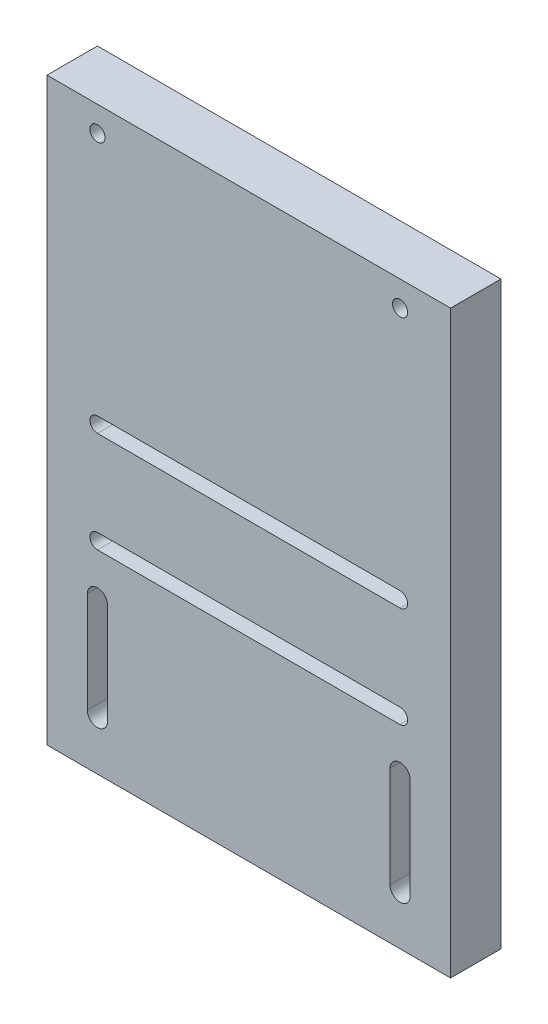
ISO-10303-21;
HEADER;
FILE_DESCRIPTION(('STEP AP214'),'2;1');
FILE_NAME('part.step','',(''),(''),'','','');
FILE_SCHEMA(('AUTOMOTIVE_DESIGN { 1 0 10303 214 1 1 1 1 }'));
ENDSEC;
DATA;
#1=APPLICATION_CONTEXT('core data for automotive mechanical design processes');
#2=APPLICATION_PROTOCOL_DEFINITION('international standard','automotive_design',2000,#1);
#3=PRODUCT_CONTEXT('',#1,'mechanical');
#4=PRODUCT('Part','Part','',(#3));
#5=PRODUCT_RELATED_PRODUCT_CATEGORY('part','',(#4));
#6=PRODUCT_DEFINITION_FORMATION('','',#4);
#7=PRODUCT_DEFINITION_CONTEXT('part definition',#1,'design');
#8=PRODUCT_DEFINITION('design','',#6,#7);
#9=PRODUCT_DEFINITION_SHAPE('','',#8);
#10=(LENGTH_UNIT() NAMED_UNIT(*) SI_UNIT(.MILLI.,.METRE.));
#11=(NAMED_UNIT(*) PLANE_ANGLE_UNIT() SI_UNIT($,.RADIAN.));
#12=(NAMED_UNIT(*) SI_UNIT($,.STERADIAN.) SOLID_ANGLE_UNIT());
#13=UNCERTAINTY_MEASURE_WITH_UNIT(LENGTH_MEASURE(1.E-05),#10,'distance_accuracy_value','');
#14=(GEOMETRIC_REPRESENTATION_CONTEXT(3) GLOBAL_UNCERTAINTY_ASSIGNED_CONTEXT((#13)) GLOBAL_UNIT_ASSIGNED_CONTEXT((#10,
#11,#12)) REPRESENTATION_CONTEXT('',''));
#15=CARTESIAN_POINT('',(0.,0.,0.));
#16=DIRECTION('',(0.,0.,1.));
#17=DIRECTION('',(1.,0.,0.));
#18=AXIS2_PLACEMENT_3D('',#15,#16,#17);
#19=CARTESIAN_POINT('',(0.,0.,10.));
#20=DIRECTION('',(0.,0.,1.));
#21=DIRECTION('',(1.,0.,0.));
#22=AXIS2_PLACEMENT_3D('',#19,#20,#21);
#23=PLANE('',#22);
#24=DIRECTION('',(0.,-1.,0.));
#25=VECTOR('',#24,1.);
#26=CARTESIAN_POINT('',(-49.7279540421685,-22.7983509814362,10.));
#27=LINE('',#26,#25);
#28=CARTESIAN_POINT('',(-49.7279540421685,-2.79835098143621,10.));
#29=VERTEX_POINT('',#28);
#30=CARTESIAN_POINT('',(-49.7279540421685,-22.7983509814362,10.));
#31=VERTEX_POINT('',#30);
#32=EDGE_CURVE('E209',#29,#31,#27,.T.);
#33=ORIENTED_EDGE('',*,*,#32,.F.);
#34=CARTESIAN_POINT('',(-47.7279540421685,-2.79835098143621,10.));
#35=DIRECTION('',(0.,0.,1.));
#36=DIRECTION('',(-1.,0.,0.));
#37=AXIS2_PLACEMENT_3D('',#34,#35,#36);
#38=CIRCLE('',#37,2.00000000000001);
#39=CARTESIAN_POINT('',(-45.7279540421685,-2.79835098143621,10.));
#40=VERTEX_POINT('',#39);
#41=EDGE_CURVE('E207',#40,#29,#38,.T.);
#42=ORIENTED_EDGE('',*,*,#41,.F.);
#43=DIRECTION('',(0.,1.,0.));
#44=VECTOR('',#43,1.);
#45=CARTESIAN_POINT('',(-45.7279540421685,-2.79835098143621,10.));
#46=LINE('',#45,#44);
#47=CARTESIAN_POINT('',(-45.7279540421685,-22.7983509814362,10.));
#48=VERTEX_POINT('',#47);
#49=EDGE_CURVE('E215',#48,#40,#46,.T.);
#50=ORIENTED_EDGE('',*,*,#49,.F.);
#51=CARTESIAN_POINT('',(-47.7279540421685,-22.7983509814362,10.));
#52=DIRECTION('',(0.,0.,1.));
#53=DIRECTION('',(1.,0.,0.));
#54=AXIS2_PLACEMENT_3D('',#51,#52,#53);
#55=CIRCLE('',#54,2.00000000000001);
#56=EDGE_CURVE('E212',#31,#48,#55,.T.);
#57=ORIENTED_EDGE('',*,*,#56,.F.);
#58=EDGE_LOOP('',(#33,#42,#50,#57));
#59=FACE_BOUND('',#58,.T.);
#60=CARTESIAN_POINT('',(-47.7279540421685,77.2016490185638,10.));
#61=DIRECTION('',(0.,0.,1.));
#62=DIRECTION('',(1.,0.,0.));
#63=AXIS2_PLACEMENT_3D('',#60,#61,#62);
#64=CIRCLE('',#63,1.5);
#65=CARTESIAN_POINT('',(-46.2279540421685,77.2016490185638,10.));
#66=VERTEX_POINT('',#65);
#67=EDGE_CURVE('E244',#66,#66,#64,.T.);
#68=ORIENTED_EDGE('',*,*,#67,.F.);
#69=EDGE_LOOP('',(#68));
#70=FACE_BOUND('',#69,.T.);
#71=DIRECTION('',(1.,0.,0.));
#72=VECTOR('',#71,1.);
#73=CARTESIAN_POINT('',(-47.7279540421685,25.7016490185638,10.));
#74=LINE('',#73,#72);
#75=CARTESIAN_POINT('',(-47.7279540421685,25.7016490185638,10.));
#76=VERTEX_POINT('',#75);
#77=CARTESIAN_POINT('',(12.2720459578315,25.7016490185638,10.));
#78=VERTEX_POINT('',#77);
#79=EDGE_CURVE('E283',#76,#78,#74,.T.);
#80=ORIENTED_EDGE('',*,*,#79,.F.);
#81=CARTESIAN_POINT('',(-47.7279540421685,27.2016490185638,10.));
#82=DIRECTION('',(0.,0.,1.));
#83=DIRECTION('',(1.,0.,0.));
#84=AXIS2_PLACEMENT_3D('',#81,#82,#83);
#85=CIRCLE('',#84,1.5);
#86=CARTESIAN_POINT('',(-47.7279540421685,28.7016490185638,10.));
#87=VERTEX_POINT('',#86);
#88=EDGE_CURVE('E281',#87,#76,#85,.T.);
#89=ORIENTED_EDGE('',*,*,#88,.F.);
#90=DIRECTION('',(-1.,0.,0.));
#91=VECTOR('',#90,1.);
#92=CARTESIAN_POINT('',(-47.7279540421685,28.7016490185638,10.));
#93=LINE('',#92,#91);
#94=CARTESIAN_POINT('',(12.2720459578315,28.7016490185638,10.));
#95=VERTEX_POINT('',#94);
#96=EDGE_CURVE('E289',#95,#87,#93,.T.);
#97=ORIENTED_EDGE('',*,*,#96,.F.);
#98=CARTESIAN_POINT('',(12.2720459578315,27.2016490185638,10.));
#99=DIRECTION('',(0.,0.,1.));
#100=DIRECTION('',(-1.,0.,0.));
#101=AXIS2_PLACEMENT_3D('',#98,#99,#100);
#102=CIRCLE('',#101,1.5);
#103=EDGE_CURVE('E286',#78,#95,#102,.T.);
#104=ORIENTED_EDGE('',*,*,#103,.F.);
#105=EDGE_LOOP('',(#80,#89,#97,#104));
#106=FACE_BOUND('',#105,.T.);
#107=DIRECTION('',(0.,-1.,0.));
#108=VECTOR('',#107,1.);
#109=CARTESIAN_POINT('',(-57.7279540421685,82.2016490185638,10.));
#110=LINE('',#109,#108);
#111=CARTESIAN_POINT('',(-57.7279540421685,82.2016490185638,10.));
#112=VERTEX_POINT('',#111);
#113=CARTESIAN_POINT('',(-57.7279540421685,-32.7983509814362,10.));
#114=VERTEX_POINT('',#113);
#115=EDGE_CURVE('E312',#112,#114,#110,.T.);
#116=ORIENTED_EDGE('',*,*,#115,.T.);
#117=DIRECTION('',(1.,0.,0.));
#118=VECTOR('',#117,1.);
#119=CARTESIAN_POINT('',(-57.7279540421685,-32.7983509814362,10.));
#120=LINE('',#119,#118);
#121=CARTESIAN_POINT('',(22.2720459578315,-32.7983509814362,10.));
#122=VERTEX_POINT('',#121);
#123=EDGE_CURVE('E315',#114,#122,#120,.T.);
#124=ORIENTED_EDGE('',*,*,#123,.T.);
#125=DIRECTION('',(0.,1.,0.));
#126=VECTOR('',#125,1.);
#127=CARTESIAN_POINT('',(22.2720459578315,82.2016490185638,10.));
#128=LINE('',#127,#126);
#129=CARTESIAN_POINT('',(22.2720459578315,82.2016490185638,10.));
#130=VERTEX_POINT('',#129);
#131=EDGE_CURVE('E318',#122,#130,#128,.T.);
#132=ORIENTED_EDGE('',*,*,#131,.T.);
#133=DIRECTION('',(-1.,0.,0.));
#134=VECTOR('',#133,1.);
#135=CARTESIAN_POINT('',(-57.7279540421685,82.2016490185638,10.));
#136=LINE('',#135,#134);
#137=EDGE_CURVE('E320',#130,#112,#136,.T.);
#138=ORIENTED_EDGE('',*,*,#137,.T.);
#139=EDGE_LOOP('',(#116,#124,#132,#138));
#140=FACE_BOUND('',#139,.T.);
#141=DIRECTION('',(1.,0.,0.));
#142=VECTOR('',#141,1.);
#143=CARTESIAN_POINT('',(12.2720459578315,5.70164901856379,10.));
#144=LINE('',#143,#142);
#145=CARTESIAN_POINT('',(-47.7279540421685,5.70164901856378,10.));
#146=VERTEX_POINT('',#145);
#147=CARTESIAN_POINT('',(12.2720459578315,5.70164901856379,10.));
#148=VERTEX_POINT('',#147);
#149=EDGE_CURVE('E252',#146,#148,#144,.T.);
#150=ORIENTED_EDGE('',*,*,#149,.F.);
#151=CARTESIAN_POINT('',(-47.7279540421685,7.20164901856379,10.));
#152=DIRECTION('',(0.,0.,1.));
#153=DIRECTION('',(1.,0.,0.));
#154=AXIS2_PLACEMENT_3D('',#151,#152,#153);
#155=CIRCLE('',#154,1.5);
#156=CARTESIAN_POINT('',(-47.7279540421685,8.70164901856379,10.));
#157=VERTEX_POINT('',#156);
#158=EDGE_CURVE('E250',#157,#146,#155,.T.);
#159=ORIENTED_EDGE('',*,*,#158,.F.);
#160=DIRECTION('',(-1.,0.,0.));
#161=VECTOR('',#160,1.);
#162=CARTESIAN_POINT('',(-47.7279540421685,8.70164901856379,10.));
#163=LINE('',#162,#161);
#164=CARTESIAN_POINT('',(12.2720459578315,8.70164901856379,10.));
#165=VERTEX_POINT('',#164);
#166=EDGE_CURVE('E258',#165,#157,#163,.T.);
#167=ORIENTED_EDGE('',*,*,#166,.F.);
#168=CARTESIAN_POINT('',(12.2720459578315,7.20164901856379,10.));
#169=DIRECTION('',(0.,0.,1.));
#170=DIRECTION('',(-1.,0.,0.));
#171=AXIS2_PLACEMENT_3D('',#168,#169,#170);
#172=CIRCLE('',#171,1.5);
#173=EDGE_CURVE('E255',#148,#165,#172,.T.);
#174=ORIENTED_EDGE('',*,*,#173,.F.);
#175=EDGE_LOOP('',(#150,#159,#167,#174));
#176=FACE_BOUND('',#175,.T.);
#177=CARTESIAN_POINT('',(12.2720459578315,77.2016490185638,10.));
#178=DIRECTION('',(0.,0.,1.));
#179=DIRECTION('',(1.,0.,0.));
#180=AXIS2_PLACEMENT_3D('',#177,#178,#179);
#181=CIRCLE('',#180,1.5);
#182=CARTESIAN_POINT('',(13.7720459578315,77.2016490185638,10.));
#183=VERTEX_POINT('',#182);
#184=EDGE_CURVE('E238',#183,#183,#181,.T.);
#185=ORIENTED_EDGE('',*,*,#184,.F.);
#186=EDGE_LOOP('',(#185));
#187=FACE_BOUND('',#186,.T.);
#188=DIRECTION('',(0.,-1.,0.));
#189=VECTOR('',#188,1.);
#190=CARTESIAN_POINT('',(10.2720459578315,-2.79835098143621,10.));
#191=LINE('',#190,#189);
#192=CARTESIAN_POINT('',(10.2720459578315,-2.79835098143621,10.));
#193=VERTEX_POINT('',#192);
#194=CARTESIAN_POINT('',(10.2720459578315,-22.7983509814362,10.));
#195=VERTEX_POINT('',#194);
#196=EDGE_CURVE('E179',#193,#195,#191,.T.);
#197=ORIENTED_EDGE('',*,*,#196,.F.);
#198=CARTESIAN_POINT('',(12.2720459578315,-2.79835098143621,10.));
#199=DIRECTION('',(0.,0.,1.));
#200=DIRECTION('',(-1.,0.,0.));
#201=AXIS2_PLACEMENT_3D('',#198,#199,#200);
#202=CIRCLE('',#201,2.);
#203=CARTESIAN_POINT('',(14.2720459578315,-2.79835098143621,10.));
#204=VERTEX_POINT('',#203);
#205=EDGE_CURVE('E171',#204,#193,#202,.T.);
#206=ORIENTED_EDGE('',*,*,#205,.F.);
#207=DIRECTION('',(0.,1.,0.));
#208=VECTOR('',#207,1.);
#209=CARTESIAN_POINT('',(14.2720459578315,-22.7983509814362,10.));
#210=LINE('',#209,#208);
#211=CARTESIAN_POINT('',(14.2720459578315,-22.7983509814362,10.));
#212=VERTEX_POINT('',#211);
#213=EDGE_CURVE('E193',#212,#204,#210,.T.);
#214=ORIENTED_EDGE('',*,*,#213,.F.);
#215=CARTESIAN_POINT('',(12.2720459578315,-22.7983509814362,10.));
#216=DIRECTION('',(0.,0.,1.));
#217=DIRECTION('',(1.,0.,0.));
#218=AXIS2_PLACEMENT_3D('',#215,#216,#217);
#219=CIRCLE('',#218,2.00000000000001);
#220=EDGE_CURVE('E191',#195,#212,#219,.T.);
#221=ORIENTED_EDGE('',*,*,#220,.F.);
#222=EDGE_LOOP('',(#197,#206,#214,#221));
#223=FACE_BOUND('',#222,.T.);
#224=ADVANCED_FACE('F34',(#59,#70,#106,#140,#176,#187,#223),#23,.T.);
#225=CARTESIAN_POINT('',(0.,0.,0.));
#226=DIRECTION('',(0.,0.,1.));
#227=DIRECTION('',(1.,0.,0.));
#228=AXIS2_PLACEMENT_3D('',#225,#226,#227);
#229=PLANE('',#228);
#230=CARTESIAN_POINT('',(-47.7279540421685,-2.79835098143621,0.));
#231=DIRECTION('',(0.,0.,1.));
#232=DIRECTION('',(-1.,0.,0.));
#233=AXIS2_PLACEMENT_3D('',#230,#231,#232);
#234=CIRCLE('',#233,2.00000000000001);
#235=CARTESIAN_POINT('',(-45.7279540421685,-2.79835098143621,0.));
#236=VERTEX_POINT('',#235);
#237=CARTESIAN_POINT('',(-49.7279540421685,-2.79835098143621,0.));
#238=VERTEX_POINT('',#237);
#239=EDGE_CURVE('E187',#236,#238,#234,.T.);
#240=ORIENTED_EDGE('',*,*,#239,.T.);
#241=DIRECTION('',(0.,-1.,0.));
#242=VECTOR('',#241,1.);
#243=CARTESIAN_POINT('',(-49.7279540421685,-22.7983509814362,0.));
#244=LINE('',#243,#242);
#245=CARTESIAN_POINT('',(-49.7279540421685,-22.7983509814362,0.));
#246=VERTEX_POINT('',#245);
#247=EDGE_CURVE('E220',#238,#246,#244,.T.);
#248=ORIENTED_EDGE('',*,*,#247,.T.);
#249=CARTESIAN_POINT('',(-47.7279540421685,-22.7983509814362,0.));
#250=DIRECTION('',(0.,0.,1.));
#251=DIRECTION('',(1.,0.,0.));
#252=AXIS2_PLACEMENT_3D('',#249,#250,#251);
#253=CIRCLE('',#252,2.00000000000001);
#254=CARTESIAN_POINT('',(-45.7279540421685,-22.7983509814362,0.));
#255=VERTEX_POINT('',#254);
#256=EDGE_CURVE('E223',#246,#255,#253,.T.);
#257=ORIENTED_EDGE('',*,*,#256,.T.);
#258=DIRECTION('',(0.,1.,0.));
#259=VECTOR('',#258,1.);
#260=CARTESIAN_POINT('',(-45.7279540421685,-2.79835098143621,0.));
#261=LINE('',#260,#259);
#262=EDGE_CURVE('E210',#255,#236,#261,.T.);
#263=ORIENTED_EDGE('',*,*,#262,.T.);
#264=EDGE_LOOP('',(#240,#248,#257,#263));
#265=FACE_BOUND('',#264,.T.);
#266=CARTESIAN_POINT('',(-47.7279540421685,77.2016490185638,0.));
#267=DIRECTION('',(0.,0.,1.));
#268=DIRECTION('',(1.,0.,0.));
#269=AXIS2_PLACEMENT_3D('',#266,#267,#268);
#270=CIRCLE('',#269,1.5);
#271=CARTESIAN_POINT('',(-46.2279540421685,77.2016490185638,0.));
#272=VERTEX_POINT('',#271);
#273=EDGE_CURVE('E241',#272,#272,#270,.T.);
#274=ORIENTED_EDGE('',*,*,#273,.T.);
#275=EDGE_LOOP('',(#274));
#276=FACE_BOUND('',#275,.T.);
#277=CARTESIAN_POINT('',(-47.7279540421685,27.2016490185638,0.));
#278=DIRECTION('',(0.,0.,1.));
#279=DIRECTION('',(1.,0.,0.));
#280=AXIS2_PLACEMENT_3D('',#277,#278,#279);
#281=CIRCLE('',#280,1.5);
#282=CARTESIAN_POINT('',(-47.7279540421685,28.7016490185638,0.));
#283=VERTEX_POINT('',#282);
#284=CARTESIAN_POINT('',(-47.7279540421685,25.7016490185638,0.));
#285=VERTEX_POINT('',#284);
#286=EDGE_CURVE('E280',#283,#285,#281,.T.);
#287=ORIENTED_EDGE('',*,*,#286,.T.);
#288=DIRECTION('',(1.,0.,0.));
#289=VECTOR('',#288,1.);
#290=CARTESIAN_POINT('',(-47.7279540421685,25.7016490185638,0.));
#291=LINE('',#290,#289);
#292=CARTESIAN_POINT('',(12.2720459578315,25.7016490185638,0.));
#293=VERTEX_POINT('',#292);
#294=EDGE_CURVE('E294',#285,#293,#291,.T.);
#295=ORIENTED_EDGE('',*,*,#294,.T.);
#296=CARTESIAN_POINT('',(12.2720459578315,27.2016490185638,0.));
#297=DIRECTION('',(0.,0.,1.));
#298=DIRECTION('',(-1.,0.,0.));
#299=AXIS2_PLACEMENT_3D('',#296,#297,#298);
#300=CIRCLE('',#299,1.5);
#301=CARTESIAN_POINT('',(12.2720459578315,28.7016490185638,0.));
#302=VERTEX_POINT('',#301);
#303=EDGE_CURVE('E297',#293,#302,#300,.T.);
#304=ORIENTED_EDGE('',*,*,#303,.T.);
#305=DIRECTION('',(-1.,0.,0.));
#306=VECTOR('',#305,1.);
#307=CARTESIAN_POINT('',(-47.7279540421685,28.7016490185638,0.));
#308=LINE('',#307,#306);
#309=EDGE_CURVE('E284',#302,#283,#308,.T.);
#310=ORIENTED_EDGE('',*,*,#309,.T.);
#311=EDGE_LOOP('',(#287,#295,#304,#310));
#312=FACE_BOUND('',#311,.T.);
#313=DIRECTION('',(0.,-1.,0.));
#314=VECTOR('',#313,1.);
#315=CARTESIAN_POINT('',(-57.7279540421685,82.2016490185638,0.));
#316=LINE('',#315,#314);
#317=CARTESIAN_POINT('',(-57.7279540421685,82.2016490185638,0.));
#318=VERTEX_POINT('',#317);
#319=CARTESIAN_POINT('',(-57.7279540421685,-32.7983509814362,0.));
#320=VERTEX_POINT('',#319);
#321=EDGE_CURVE('E311',#318,#320,#316,.T.);
#322=ORIENTED_EDGE('',*,*,#321,.F.);
#323=DIRECTION('',(-1.,0.,0.));
#324=VECTOR('',#323,1.);
#325=CARTESIAN_POINT('',(-57.7279540421685,82.2016490185638,0.));
#326=LINE('',#325,#324);
#327=CARTESIAN_POINT('',(22.2720459578315,82.2016490185638,0.));
#328=VERTEX_POINT('',#327);
#329=EDGE_CURVE('E316',#328,#318,#326,.T.);
#330=ORIENTED_EDGE('',*,*,#329,.F.);
#331=DIRECTION('',(0.,1.,0.));
#332=VECTOR('',#331,1.);
#333=CARTESIAN_POINT('',(22.2720459578315,82.2016490185638,0.));
#334=LINE('',#333,#332);
#335=CARTESIAN_POINT('',(22.2720459578315,-32.7983509814362,0.));
#336=VERTEX_POINT('',#335);
#337=EDGE_CURVE('E327',#336,#328,#334,.T.);
#338=ORIENTED_EDGE('',*,*,#337,.F.);
#339=DIRECTION('',(1.,0.,0.));
#340=VECTOR('',#339,1.);
#341=CARTESIAN_POINT('',(-57.7279540421685,-32.7983509814362,0.));
#342=LINE('',#341,#340);
#343=EDGE_CURVE('E325',#320,#336,#342,.T.);
#344=ORIENTED_EDGE('',*,*,#343,.F.);
#345=EDGE_LOOP('',(#322,#330,#338,#344));
#346=FACE_BOUND('',#345,.T.);
#347=CARTESIAN_POINT('',(-47.7279540421685,7.20164901856379,0.));
#348=DIRECTION('',(0.,0.,1.));
#349=DIRECTION('',(1.,0.,0.));
#350=AXIS2_PLACEMENT_3D('',#347,#348,#349);
#351=CIRCLE('',#350,1.5);
#352=CARTESIAN_POINT('',(-47.7279540421685,8.70164901856379,0.));
#353=VERTEX_POINT('',#352);
#354=CARTESIAN_POINT('',(-47.7279540421685,5.70164901856378,0.));
#355=VERTEX_POINT('',#354);
#356=EDGE_CURVE('E247',#353,#355,#351,.T.);
#357=ORIENTED_EDGE('',*,*,#356,.T.);
#358=DIRECTION('',(1.,0.,0.));
#359=VECTOR('',#358,1.);
#360=CARTESIAN_POINT('',(12.2720459578315,5.70164901856379,0.));
#361=LINE('',#360,#359);
#362=CARTESIAN_POINT('',(12.2720459578315,5.70164901856379,0.));
#363=VERTEX_POINT('',#362);
#364=EDGE_CURVE('E263',#355,#363,#361,.T.);
#365=ORIENTED_EDGE('',*,*,#364,.T.);
#366=CARTESIAN_POINT('',(12.2720459578315,7.20164901856379,0.));
#367=DIRECTION('',(0.,0.,1.));
#368=DIRECTION('',(-1.,0.,0.));
#369=AXIS2_PLACEMENT_3D('',#366,#367,#368);
#370=CIRCLE('',#369,1.5);
#371=CARTESIAN_POINT('',(12.2720459578315,8.70164901856379,0.));
#372=VERTEX_POINT('',#371);
#373=EDGE_CURVE('E266',#363,#372,#370,.T.);
#374=ORIENTED_EDGE('',*,*,#373,.T.);
#375=DIRECTION('',(-1.,0.,0.));
#376=VECTOR('',#375,1.);
#377=CARTESIAN_POINT('',(-47.7279540421685,8.70164901856379,0.));
#378=LINE('',#377,#376);
#379=EDGE_CURVE('E253',#372,#353,#378,.T.);
#380=ORIENTED_EDGE('',*,*,#379,.T.);
#381=EDGE_LOOP('',(#357,#365,#374,#380));
#382=FACE_BOUND('',#381,.T.);
#383=CARTESIAN_POINT('',(12.2720459578315,77.2016490185638,0.));
#384=DIRECTION('',(0.,0.,1.));
#385=DIRECTION('',(1.,0.,0.));
#386=AXIS2_PLACEMENT_3D('',#383,#384,#385);
#387=CIRCLE('',#386,1.5);
#388=CARTESIAN_POINT('',(13.7720459578315,77.2016490185638,0.));
#389=VERTEX_POINT('',#388);
#390=EDGE_CURVE('E237',#389,#389,#387,.T.);
#391=ORIENTED_EDGE('',*,*,#390,.T.);
#392=EDGE_LOOP('',(#391));
#393=FACE_BOUND('',#392,.T.);
#394=CARTESIAN_POINT('',(12.2720459578315,-2.79835098143621,0.));
#395=DIRECTION('',(0.,0.,1.));
#396=DIRECTION('',(-1.,0.,0.));
#397=AXIS2_PLACEMENT_3D('',#394,#395,#396);
#398=CIRCLE('',#397,2.);
#399=CARTESIAN_POINT('',(14.2720459578315,-2.79835098143621,0.));
#400=VERTEX_POINT('',#399);
#401=CARTESIAN_POINT('',(10.2720459578315,-2.79835098143621,0.));
#402=VERTEX_POINT('',#401);
#403=EDGE_CURVE('E57',#400,#402,#398,.T.);
#404=ORIENTED_EDGE('',*,*,#403,.T.);
#405=DIRECTION('',(0.,-1.,0.));
#406=VECTOR('',#405,1.);
#407=CARTESIAN_POINT('',(10.2720459578315,-2.79835098143621,0.));
#408=LINE('',#407,#406);
#409=CARTESIAN_POINT('',(10.2720459578315,-22.7983509814362,0.));
#410=VERTEX_POINT('',#409);
#411=EDGE_CURVE('E186',#402,#410,#408,.T.);
#412=ORIENTED_EDGE('',*,*,#411,.T.);
#413=CARTESIAN_POINT('',(12.2720459578315,-22.7983509814362,0.));
#414=DIRECTION('',(0.,0.,1.));
#415=DIRECTION('',(1.,0.,0.));
#416=AXIS2_PLACEMENT_3D('',#413,#414,#415);
#417=CIRCLE('',#416,2.00000000000001);
#418=CARTESIAN_POINT('',(14.2720459578315,-22.7983509814362,0.));
#419=VERTEX_POINT('',#418);
#420=EDGE_CURVE('E199',#410,#419,#417,.T.);
#421=ORIENTED_EDGE('',*,*,#420,.T.);
#422=DIRECTION('',(0.,1.,0.));
#423=VECTOR('',#422,1.);
#424=CARTESIAN_POINT('',(14.2720459578315,-22.7983509814362,0.));
#425=LINE('',#424,#423);
#426=EDGE_CURVE('E180',#419,#400,#425,.T.);
#427=ORIENTED_EDGE('',*,*,#426,.T.);
#428=EDGE_LOOP('',(#404,#412,#421,#427));
#429=FACE_BOUND('',#428,.T.);
#430=ADVANCED_FACE('F345',(#265,#276,#312,#346,#382,#393,#429),#229,.F.);
#431=CARTESIAN_POINT('',(-57.7279540421685,82.2016490185638,10.));
#432=DIRECTION('',(1.,0.,0.));
#433=DIRECTION('',(0.,1.,0.));
#434=AXIS2_PLACEMENT_3D('',#431,#432,#433);
#435=PLANE('',#434);
#436=ORIENTED_EDGE('',*,*,#321,.T.);
#437=DIRECTION('',(0.,0.,-1.));
#438=VECTOR('',#437,1.);
#439=CARTESIAN_POINT('',(-57.7279540421685,-32.7983509814362,10.));
#440=LINE('',#439,#438);
#441=EDGE_CURVE('E11',#114,#320,#440,.T.);
#442=ORIENTED_EDGE('',*,*,#441,.F.);
#443=ORIENTED_EDGE('',*,*,#115,.F.);
#444=DIRECTION('',(0.,0.,-1.));
#445=VECTOR('',#444,1.);
#446=CARTESIAN_POINT('',(-57.7279540421685,82.2016490185638,10.));
#447=LINE('',#446,#445);
#448=EDGE_CURVE('E322',#112,#318,#447,.T.);
#449=ORIENTED_EDGE('',*,*,#448,.T.);
#450=EDGE_LOOP('',(#436,#442,#443,#449));
#451=FACE_BOUND('',#450,.T.);
#452=ADVANCED_FACE('F36',(#451),#435,.F.);
#453=CARTESIAN_POINT('',(-57.7279540421685,-32.7983509814362,10.));
#454=DIRECTION('',(0.,1.,0.));
#455=DIRECTION('',(0.,0.,1.));
#456=AXIS2_PLACEMENT_3D('',#453,#454,#455);
#457=PLANE('',#456);
#458=ORIENTED_EDGE('',*,*,#343,.T.);
#459=DIRECTION('',(0.,0.,-1.));
#460=VECTOR('',#459,1.);
#461=CARTESIAN_POINT('',(22.2720459578315,-32.7983509814362,10.));
#462=LINE('',#461,#460);
#463=EDGE_CURVE('E42',#122,#336,#462,.T.);
#464=ORIENTED_EDGE('',*,*,#463,.F.);
#465=ORIENTED_EDGE('',*,*,#123,.F.);
#466=ORIENTED_EDGE('',*,*,#441,.T.);
#467=EDGE_LOOP('',(#458,#464,#465,#466));
#468=FACE_BOUND('',#467,.T.);
#469=ADVANCED_FACE('F356',(#468),#457,.F.);
#470=CARTESIAN_POINT('',(22.2720459578315,82.2016490185638,10.));
#471=DIRECTION('',(-1.,0.,0.));
#472=DIRECTION('',(0.,-1.,0.));
#473=AXIS2_PLACEMENT_3D('',#470,#471,#472);
#474=PLANE('',#473);
#475=ORIENTED_EDGE('',*,*,#337,.T.);
#476=DIRECTION('',(0.,0.,-1.));
#477=VECTOR('',#476,1.);
#478=CARTESIAN_POINT('',(22.2720459578315,82.2016490185638,10.));
#479=LINE('',#478,#477);
#480=EDGE_CURVE('E332',#130,#328,#479,.T.);
#481=ORIENTED_EDGE('',*,*,#480,.F.);
#482=ORIENTED_EDGE('',*,*,#131,.F.);
#483=ORIENTED_EDGE('',*,*,#463,.T.);
#484=EDGE_LOOP('',(#475,#481,#482,#483));
#485=FACE_BOUND('',#484,.T.);
#486=ADVANCED_FACE('F339',(#485),#474,.F.);
#487=CARTESIAN_POINT('',(-57.7279540421685,82.2016490185638,10.));
#488=DIRECTION('',(0.,-1.,0.));
#489=DIRECTION('',(1.,0.,0.));
#490=AXIS2_PLACEMENT_3D('',#487,#488,#489);
#491=PLANE('',#490);
#492=ORIENTED_EDGE('',*,*,#329,.T.);
#493=ORIENTED_EDGE('',*,*,#448,.F.);
#494=ORIENTED_EDGE('',*,*,#137,.F.);
#495=ORIENTED_EDGE('',*,*,#480,.T.);
#496=EDGE_LOOP('',(#492,#493,#494,#495));
#497=FACE_BOUND('',#496,.T.);
#498=ADVANCED_FACE('F349',(#497),#491,.F.);
#499=CARTESIAN_POINT('',(-47.7279540421685,27.2016490185638,10.));
#500=DIRECTION('',(0.,0.,-1.));
#501=DIRECTION('',(-1.,0.,0.));
#502=AXIS2_PLACEMENT_3D('',#499,#500,#501);
#503=CYLINDRICAL_SURFACE('',#502,1.5);
#504=ORIENTED_EDGE('',*,*,#286,.F.);
#505=DIRECTION('',(0.,0.,-1.));
#506=VECTOR('',#505,1.);
#507=CARTESIAN_POINT('',(-47.7279540421685,28.7016490185638,10.));
#508=LINE('',#507,#506);
#509=EDGE_CURVE('E291',#87,#283,#508,.T.);
#510=ORIENTED_EDGE('',*,*,#509,.F.);
#511=ORIENTED_EDGE('',*,*,#88,.T.);
#512=DIRECTION('',(0.,0.,-1.));
#513=VECTOR('',#512,1.);
#514=CARTESIAN_POINT('',(-47.7279540421685,25.7016490185638,10.));
#515=LINE('',#514,#513);
#516=EDGE_CURVE('E308',#76,#285,#515,.T.);
#517=ORIENTED_EDGE('',*,*,#516,.T.);
#518=EDGE_LOOP('',(#504,#510,#511,#517));
#519=FACE_BOUND('',#518,.T.);
#520=ADVANCED_FACE('F374',(#519),#503,.F.);
#521=CARTESIAN_POINT('',(-47.7279540421685,25.7016490185638,10.));
#522=DIRECTION('',(0.,1.,0.));
#523=DIRECTION('',(-1.,0.,0.));
#524=AXIS2_PLACEMENT_3D('',#521,#522,#523);
#525=PLANE('',#524);
#526=ORIENTED_EDGE('',*,*,#294,.F.);
#527=ORIENTED_EDGE('',*,*,#516,.F.);
#528=ORIENTED_EDGE('',*,*,#79,.T.);
#529=DIRECTION('',(0.,0.,-1.));
#530=VECTOR('',#529,1.);
#531=CARTESIAN_POINT('',(12.2720459578315,25.7016490185638,10.));
#532=LINE('',#531,#530);
#533=EDGE_CURVE('E306',#78,#293,#532,.T.);
#534=ORIENTED_EDGE('',*,*,#533,.T.);
#535=EDGE_LOOP('',(#526,#527,#528,#534));
#536=FACE_BOUND('',#535,.T.);
#537=ADVANCED_FACE('F381',(#536),#525,.T.);
#538=CARTESIAN_POINT('',(12.2720459578315,27.2016490185638,10.));
#539=DIRECTION('',(0.,0.,-1.));
#540=DIRECTION('',(-1.,0.,0.));
#541=AXIS2_PLACEMENT_3D('',#538,#539,#540);
#542=CYLINDRICAL_SURFACE('',#541,1.5);
#543=ORIENTED_EDGE('',*,*,#303,.F.);
#544=ORIENTED_EDGE('',*,*,#533,.F.);
#545=ORIENTED_EDGE('',*,*,#103,.T.);
#546=DIRECTION('',(0.,0.,-1.));
#547=VECTOR('',#546,1.);
#548=CARTESIAN_POINT('',(12.2720459578315,28.7016490185638,10.));
#549=LINE('',#548,#547);
#550=EDGE_CURVE('E304',#95,#302,#549,.T.);
#551=ORIENTED_EDGE('',*,*,#550,.T.);
#552=EDGE_LOOP('',(#543,#544,#545,#551));
#553=FACE_BOUND('',#552,.T.);
#554=ADVANCED_FACE('F386',(#553),#542,.F.);
#555=CARTESIAN_POINT('',(-47.7279540421685,28.7016490185638,10.));
#556=DIRECTION('',(0.,-1.,0.));
#557=DIRECTION('',(0.,0.,-1.));
#558=AXIS2_PLACEMENT_3D('',#555,#556,#557);
#559=PLANE('',#558);
#560=ORIENTED_EDGE('',*,*,#309,.F.);
#561=ORIENTED_EDGE('',*,*,#550,.F.);
#562=ORIENTED_EDGE('',*,*,#96,.T.);
#563=ORIENTED_EDGE('',*,*,#509,.T.);
#564=EDGE_LOOP('',(#560,#561,#562,#563));
#565=FACE_BOUND('',#564,.T.);
#566=ADVANCED_FACE('F394',(#565),#559,.T.);
#567=CARTESIAN_POINT('',(-47.7279540421685,7.20164901856379,10.));
#568=DIRECTION('',(0.,0.,-1.));
#569=DIRECTION('',(-1.,0.,0.));
#570=AXIS2_PLACEMENT_3D('',#567,#568,#569);
#571=CYLINDRICAL_SURFACE('',#570,1.5);
#572=ORIENTED_EDGE('',*,*,#356,.F.);
#573=DIRECTION('',(0.,0.,-1.));
#574=VECTOR('',#573,1.);
#575=CARTESIAN_POINT('',(-47.7279540421685,8.70164901856379,10.));
#576=LINE('',#575,#574);
#577=EDGE_CURVE('E260',#157,#353,#576,.T.);
#578=ORIENTED_EDGE('',*,*,#577,.F.);
#579=ORIENTED_EDGE('',*,*,#158,.T.);
#580=DIRECTION('',(0.,0.,-1.));
#581=VECTOR('',#580,1.);
#582=CARTESIAN_POINT('',(-47.7279540421685,5.70164901856378,10.));
#583=LINE('',#582,#581);
#584=EDGE_CURVE('E277',#146,#355,#583,.T.);
#585=ORIENTED_EDGE('',*,*,#584,.T.);
#586=EDGE_LOOP('',(#572,#578,#579,#585));
#587=FACE_BOUND('',#586,.T.);
#588=ADVANCED_FACE('F407',(#587),#571,.F.);
#589=CARTESIAN_POINT('',(12.2720459578315,5.70164901856379,10.));
#590=DIRECTION('',(0.,1.,0.));
#591=DIRECTION('',(-1.,0.,0.));
#592=AXIS2_PLACEMENT_3D('',#589,#590,#591);
#593=PLANE('',#592);
#594=ORIENTED_EDGE('',*,*,#364,.F.);
#595=ORIENTED_EDGE('',*,*,#584,.F.);
#596=ORIENTED_EDGE('',*,*,#149,.T.);
#597=DIRECTION('',(0.,0.,-1.));
#598=VECTOR('',#597,1.);
#599=CARTESIAN_POINT('',(12.2720459578315,5.70164901856379,10.));
#600=LINE('',#599,#598);
#601=EDGE_CURVE('E275',#148,#363,#600,.T.);
#602=ORIENTED_EDGE('',*,*,#601,.T.);
#603=EDGE_LOOP('',(#594,#595,#596,#602));
#604=FACE_BOUND('',#603,.T.);
#605=ADVANCED_FACE('F412',(#604),#593,.T.);
#606=CARTESIAN_POINT('',(12.2720459578315,7.20164901856379,10.));
#607=DIRECTION('',(0.,0.,-1.));
#608=DIRECTION('',(-1.,0.,0.));
#609=AXIS2_PLACEMENT_3D('',#606,#607,#608);
#610=CYLINDRICAL_SURFACE('',#609,1.5);
#611=ORIENTED_EDGE('',*,*,#373,.F.);
#612=ORIENTED_EDGE('',*,*,#601,.F.);
#613=ORIENTED_EDGE('',*,*,#173,.T.);
#614=DIRECTION('',(0.,0.,-1.));
#615=VECTOR('',#614,1.);
#616=CARTESIAN_POINT('',(12.2720459578315,8.70164901856379,10.));
#617=LINE('',#616,#615);
#618=EDGE_CURVE('E273',#165,#372,#617,.T.);
#619=ORIENTED_EDGE('',*,*,#618,.T.);
#620=EDGE_LOOP('',(#611,#612,#613,#619));
#621=FACE_BOUND('',#620,.T.);
#622=ADVANCED_FACE('F416',(#621),#610,.F.);
#623=CARTESIAN_POINT('',(-47.7279540421685,8.70164901856379,10.));
#624=DIRECTION('',(0.,-1.,0.));
#625=DIRECTION('',(0.,0.,-1.));
#626=AXIS2_PLACEMENT_3D('',#623,#624,#625);
#627=PLANE('',#626);
#628=ORIENTED_EDGE('',*,*,#379,.F.);
#629=ORIENTED_EDGE('',*,*,#618,.F.);
#630=ORIENTED_EDGE('',*,*,#166,.T.);
#631=ORIENTED_EDGE('',*,*,#577,.T.);
#632=EDGE_LOOP('',(#628,#629,#630,#631));
#633=FACE_BOUND('',#632,.T.);
#634=ADVANCED_FACE('F420',(#633),#627,.T.);
#635=CARTESIAN_POINT('',(-47.7279540421685,77.2016490185638,10.));
#636=DIRECTION('',(0.,0.,-1.));
#637=DIRECTION('',(-1.,0.,0.));
#638=AXIS2_PLACEMENT_3D('',#635,#636,#637);
#639=CYLINDRICAL_SURFACE('',#638,1.5);
#640=ORIENTED_EDGE('',*,*,#67,.T.);
#641=EDGE_LOOP('',(#640));
#642=FACE_BOUND('',#641,.T.);
#643=ORIENTED_EDGE('',*,*,#273,.F.);
#644=EDGE_LOOP('',(#643));
#645=FACE_BOUND('',#644,.T.);
#646=ADVANCED_FACE('F424',(#642,#645),#639,.F.);
#647=CARTESIAN_POINT('',(12.2720459578315,77.2016490185638,10.));
#648=DIRECTION('',(0.,0.,-1.));
#649=DIRECTION('',(-1.,0.,0.));
#650=AXIS2_PLACEMENT_3D('',#647,#648,#649);
#651=CYLINDRICAL_SURFACE('',#650,1.5);
#652=ORIENTED_EDGE('',*,*,#184,.T.);
#653=EDGE_LOOP('',(#652));
#654=FACE_BOUND('',#653,.T.);
#655=ORIENTED_EDGE('',*,*,#390,.F.);
#656=EDGE_LOOP('',(#655));
#657=FACE_BOUND('',#656,.T.);
#658=ADVANCED_FACE('F428',(#654,#657),#651,.F.);
#659=CARTESIAN_POINT('',(-47.7279540421685,-2.79835098143621,10.));
#660=DIRECTION('',(0.,0.,-1.));
#661=DIRECTION('',(-1.,0.,0.));
#662=AXIS2_PLACEMENT_3D('',#659,#660,#661);
#663=CYLINDRICAL_SURFACE('',#662,2.00000000000001);
#664=ORIENTED_EDGE('',*,*,#239,.F.);
#665=DIRECTION('',(0.,0.,-1.));
#666=VECTOR('',#665,1.);
#667=CARTESIAN_POINT('',(-45.7279540421685,-2.79835098143621,10.));
#668=LINE('',#667,#666);
#669=EDGE_CURVE('E217',#40,#236,#668,.T.);
#670=ORIENTED_EDGE('',*,*,#669,.F.);
#671=ORIENTED_EDGE('',*,*,#41,.T.);
#672=DIRECTION('',(0.,0.,-1.));
#673=VECTOR('',#672,1.);
#674=CARTESIAN_POINT('',(-49.7279540421685,-2.79835098143621,10.));
#675=LINE('',#674,#673);
#676=EDGE_CURVE('E234',#29,#238,#675,.T.);
#677=ORIENTED_EDGE('',*,*,#676,.T.);
#678=EDGE_LOOP('',(#664,#670,#671,#677));
#679=FACE_BOUND('',#678,.T.);
#680=ADVANCED_FACE('F432',(#679),#663,.F.);
#681=CARTESIAN_POINT('',(-49.7279540421685,-22.7983509814362,10.));
#682=DIRECTION('',(1.,0.,0.));
#683=DIRECTION('',(0.,1.,0.));
#684=AXIS2_PLACEMENT_3D('',#681,#682,#683);
#685=PLANE('',#684);
#686=ORIENTED_EDGE('',*,*,#247,.F.);
#687=ORIENTED_EDGE('',*,*,#676,.F.);
#688=ORIENTED_EDGE('',*,*,#32,.T.);
#689=DIRECTION('',(0.,0.,-1.));
#690=VECTOR('',#689,1.);
#691=CARTESIAN_POINT('',(-49.7279540421685,-22.7983509814362,10.));
#692=LINE('',#691,#690);
#693=EDGE_CURVE('E232',#31,#246,#692,.T.);
#694=ORIENTED_EDGE('',*,*,#693,.T.);
#695=EDGE_LOOP('',(#686,#687,#688,#694));
#696=FACE_BOUND('',#695,.T.);
#697=ADVANCED_FACE('F436',(#696),#685,.T.);
#698=CARTESIAN_POINT('',(-47.7279540421685,-22.7983509814362,10.));
#699=DIRECTION('',(0.,0.,-1.));
#700=DIRECTION('',(-1.,0.,0.));
#701=AXIS2_PLACEMENT_3D('',#698,#699,#700);
#702=CYLINDRICAL_SURFACE('',#701,2.00000000000001);
#703=ORIENTED_EDGE('',*,*,#256,.F.);
#704=ORIENTED_EDGE('',*,*,#693,.F.);
#705=ORIENTED_EDGE('',*,*,#56,.T.);
#706=DIRECTION('',(0.,0.,-1.));
#707=VECTOR('',#706,1.);
#708=CARTESIAN_POINT('',(-45.7279540421685,-22.7983509814362,10.));
#709=LINE('',#708,#707);
#710=EDGE_CURVE('E230',#48,#255,#709,.T.);
#711=ORIENTED_EDGE('',*,*,#710,.T.);
#712=EDGE_LOOP('',(#703,#704,#705,#711));
#713=FACE_BOUND('',#712,.T.);
#714=ADVANCED_FACE('F440',(#713),#702,.F.);
#715=CARTESIAN_POINT('',(-45.7279540421685,-2.79835098143621,10.));
#716=DIRECTION('',(-1.,0.,0.));
#717=DIRECTION('',(0.,0.,1.));
#718=AXIS2_PLACEMENT_3D('',#715,#716,#717);
#719=PLANE('',#718);
#720=ORIENTED_EDGE('',*,*,#262,.F.);
#721=ORIENTED_EDGE('',*,*,#710,.F.);
#722=ORIENTED_EDGE('',*,*,#49,.T.);
#723=ORIENTED_EDGE('',*,*,#669,.T.);
#724=EDGE_LOOP('',(#720,#721,#722,#723));
#725=FACE_BOUND('',#724,.T.);
#726=ADVANCED_FACE('F444',(#725),#719,.T.);
#727=CARTESIAN_POINT('',(12.2720459578315,-2.79835098143621,10.));
#728=DIRECTION('',(0.,0.,-1.));
#729=DIRECTION('',(-1.,0.,0.));
#730=AXIS2_PLACEMENT_3D('',#727,#728,#729);
#731=CYLINDRICAL_SURFACE('',#730,2.);
#732=ORIENTED_EDGE('',*,*,#403,.F.);
#733=DIRECTION('',(0.,0.,-1.));
#734=VECTOR('',#733,1.);
#735=CARTESIAN_POINT('',(14.2720459578315,-2.79835098143621,10.));
#736=LINE('',#735,#734);
#737=EDGE_CURVE('E175',#204,#400,#736,.T.);
#738=ORIENTED_EDGE('',*,*,#737,.F.);
#739=ORIENTED_EDGE('',*,*,#205,.T.);
#740=DIRECTION('',(0.,0.,-1.));
#741=VECTOR('',#740,1.);
#742=CARTESIAN_POINT('',(10.2720459578315,-2.79835098143621,10.));
#743=LINE('',#742,#741);
#744=EDGE_CURVE('E174',#193,#402,#743,.T.);
#745=ORIENTED_EDGE('',*,*,#744,.T.);
#746=EDGE_LOOP('',(#732,#738,#739,#745));
#747=FACE_BOUND('',#746,.T.);
#748=ADVANCED_FACE('F173',(#747),#731,.F.);
#749=CARTESIAN_POINT('',(10.2720459578315,-2.79835098143621,10.));
#750=DIRECTION('',(1.,0.,0.));
#751=DIRECTION('',(0.,1.,0.));
#752=AXIS2_PLACEMENT_3D('',#749,#750,#751);
#753=PLANE('',#752);
#754=ORIENTED_EDGE('',*,*,#411,.F.);
#755=ORIENTED_EDGE('',*,*,#744,.F.);
#756=ORIENTED_EDGE('',*,*,#196,.T.);
#757=DIRECTION('',(0.,0.,-1.));
#758=VECTOR('',#757,1.);
#759=CARTESIAN_POINT('',(10.2720459578315,-22.7983509814362,10.));
#760=LINE('',#759,#758);
#761=EDGE_CURVE('E188',#195,#410,#760,.T.);
#762=ORIENTED_EDGE('',*,*,#761,.T.);
#763=EDGE_LOOP('',(#754,#755,#756,#762));
#764=FACE_BOUND('',#763,.T.);
#765=ADVANCED_FACE('F183',(#764),#753,.T.);
#766=CARTESIAN_POINT('',(12.2720459578315,-22.7983509814362,10.));
#767=DIRECTION('',(0.,0.,-1.));
#768=DIRECTION('',(-1.,0.,0.));
#769=AXIS2_PLACEMENT_3D('',#766,#767,#768);
#770=CYLINDRICAL_SURFACE('',#769,2.00000000000001);
#771=ORIENTED_EDGE('',*,*,#420,.F.);
#772=ORIENTED_EDGE('',*,*,#761,.F.);
#773=ORIENTED_EDGE('',*,*,#220,.T.);
#774=DIRECTION('',(0.,0.,-1.));
#775=VECTOR('',#774,1.);
#776=CARTESIAN_POINT('',(14.2720459578315,-22.7983509814362,10.));
#777=LINE('',#776,#775);
#778=EDGE_CURVE('E49',#212,#419,#777,.T.);
#779=ORIENTED_EDGE('',*,*,#778,.T.);
#780=EDGE_LOOP('',(#771,#772,#773,#779));
#781=FACE_BOUND('',#780,.T.);
#782=ADVANCED_FACE('F453',(#781),#770,.F.);
#783=CARTESIAN_POINT('',(14.2720459578315,-22.7983509814362,10.));
#784=DIRECTION('',(-1.,0.,0.));
#785=DIRECTION('',(0.,-1.,0.));
#786=AXIS2_PLACEMENT_3D('',#783,#784,#785);
#787=PLANE('',#786);
#788=ORIENTED_EDGE('',*,*,#426,.F.);
#789=ORIENTED_EDGE('',*,*,#778,.F.);
#790=ORIENTED_EDGE('',*,*,#213,.T.);
#791=ORIENTED_EDGE('',*,*,#737,.T.);
#792=EDGE_LOOP('',(#788,#789,#790,#791));
#793=FACE_BOUND('',#792,.T.);
#794=ADVANCED_FACE('F456',(#793),#787,.T.);
#795=CLOSED_SHELL('',(#224,#430,#452,#469,#486,#498,#520,#537,#554,#566,#588,#605,#622,#634,
#646,#658,#680,#697,#714,#726,#748,#765,#782,#794));
#796=MANIFOLD_SOLID_BREP('B2',#795);
#797=ADVANCED_BREP_SHAPE_REPRESENTATION('',(#18,#796),#14);
#798=SHAPE_DEFINITION_REPRESENTATION(#9,#797);
ENDSEC;
END-ISO-10303-21;
